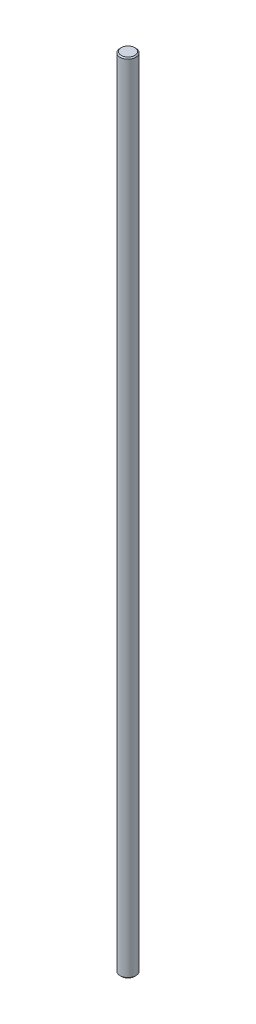
ISO-10303-21;
HEADER;
FILE_DESCRIPTION(('STEP AP214'),'2;1');
FILE_NAME('part.step','',(''),(''),'','','');
FILE_SCHEMA(('AUTOMOTIVE_DESIGN { 1 0 10303 214 1 1 1 1 }'));
ENDSEC;
DATA;
#1=APPLICATION_CONTEXT('core data for automotive mechanical design processes');
#2=APPLICATION_PROTOCOL_DEFINITION('international standard','automotive_design',2000,#1);
#3=PRODUCT_CONTEXT('',#1,'mechanical');
#4=PRODUCT('Part','Part','',(#3));
#5=PRODUCT_RELATED_PRODUCT_CATEGORY('part','',(#4));
#6=PRODUCT_DEFINITION_FORMATION('','',#4);
#7=PRODUCT_DEFINITION_CONTEXT('part definition',#1,'design');
#8=PRODUCT_DEFINITION('design','',#6,#7);
#9=PRODUCT_DEFINITION_SHAPE('','',#8);
#10=(LENGTH_UNIT() NAMED_UNIT(*) SI_UNIT(.MILLI.,.METRE.));
#11=(NAMED_UNIT(*) PLANE_ANGLE_UNIT() SI_UNIT($,.RADIAN.));
#12=(NAMED_UNIT(*) SI_UNIT($,.STERADIAN.) SOLID_ANGLE_UNIT());
#13=UNCERTAINTY_MEASURE_WITH_UNIT(LENGTH_MEASURE(1.E-05),#10,'distance_accuracy_value','');
#14=(GEOMETRIC_REPRESENTATION_CONTEXT(3) GLOBAL_UNCERTAINTY_ASSIGNED_CONTEXT((#13)) GLOBAL_UNIT_ASSIGNED_CONTEXT((#10,
#11,#12)) REPRESENTATION_CONTEXT('',''));
#15=CARTESIAN_POINT('',(0.,0.,0.));
#16=DIRECTION('',(0.,0.,1.));
#17=DIRECTION('',(1.,0.,0.));
#18=AXIS2_PLACEMENT_3D('',#15,#16,#17);
#19=CARTESIAN_POINT('',(0.,710.,0.));
#20=DIRECTION('',(0.,-1.,0.));
#21=DIRECTION('',(0.,0.,-1.));
#22=AXIS2_PLACEMENT_3D('',#19,#20,#21);
#23=CYLINDRICAL_SURFACE('',#22,7.);
#24=DIRECTION('',(0.,-1.,0.));
#25=VECTOR('',#24,1.);
#26=CARTESIAN_POINT('',(4.,710.,-5.74456264653803));
#27=LINE('',#26,#25);
#28=CARTESIAN_POINT('',(4.,236.,-5.74456264653803));
#29=VERTEX_POINT('',#28);
#30=CARTESIAN_POINT('',(4.,473.,-5.74456264653803));
#31=VERTEX_POINT('',#30);
#32=EDGE_CURVE('E47',#29,#31,#27,.F.);
#33=ORIENTED_EDGE('',*,*,#32,.T.);
#34=CARTESIAN_POINT('',(3.99999999999999,473.,-5.74456264653804));
#35=CARTESIAN_POINT('',(4.00002143590253,473.102267799723,-5.74452371324322));
#36=CARTESIAN_POINT('',(3.99607883430023,473.204513180416,-5.74729256524474));
#37=CARTESIAN_POINT('',(3.98043539907031,473.40803948732,-5.75815051881484));
#38=CARTESIAN_POINT('',(3.96874119071111,473.509321162285,-5.76623507702227));
#39=CARTESIAN_POINT('',(3.93787689539834,473.709444946865,-5.78735271082415));
#40=CARTESIAN_POINT('',(3.91876199023616,473.808299466083,-5.80034924155759));
#41=CARTESIAN_POINT('',(3.87334321428668,474.003632233979,-5.83077695110377));
#42=CARTESIAN_POINT('',(3.84703810912315,474.100110071539,-5.84820889132903));
#43=CARTESIAN_POINT('',(3.75799949911336,474.384464367199,-5.9061377584936));
#44=CARTESIAN_POINT('',(3.6850143581201,474.568071511496,-5.95236142454356));
#45=CARTESIAN_POINT('',(3.5142466837881,474.920573069424,-6.0547464828584));
#46=CARTESIAN_POINT('',(3.41641332319506,475.089436361353,-6.11092817230876));
#47=CARTESIAN_POINT('',(3.18634104077984,475.42765124983,-6.23426588641106));
#48=CARTESIAN_POINT('',(3.05151440124681,475.59505016869,-6.30195063162779));
#49=CARTESIAN_POINT('',(2.75652655885666,475.906464184931,-6.43644252342176));
#50=CARTESIAN_POINT('',(2.5963569398674,476.050471481894,-6.50324937044785));
#51=CARTESIAN_POINT('',(2.33095531633808,476.252786569404,-6.60126681147925));
#52=CARTESIAN_POINT('',(2.23359942046429,476.32041688373,-6.63492225042094));
#53=CARTESIAN_POINT('',(2.03256441910529,476.447141472492,-6.69923861969471));
#54=CARTESIAN_POINT('',(1.9288879219001,476.506239234539,-6.72990077183917));
#55=CARTESIAN_POINT('',(1.71584290166404,476.615273050641,-6.78734514736684));
#56=CARTESIAN_POINT('',(1.60647639402014,476.665212320631,-6.81412873198171));
#57=CARTESIAN_POINT('',(1.38278246406313,476.755322126529,-6.86301758887103));
#58=CARTESIAN_POINT('',(1.26845576883076,476.795494088499,-6.88512354403466));
#59=CARTESIAN_POINT('',(1.04606986327156,476.862383289302,-6.92223243110546));
#60=CARTESIAN_POINT('',(0.938349533807794,476.889975777829,-6.93769041049513));
#61=CARTESIAN_POINT('',(0.720419815770633,476.93616530485,-6.96369384599117));
#62=CARTESIAN_POINT('',(0.610210760979256,476.954763542218,-6.9742399568111));
#63=CARTESIAN_POINT('',(0.388320693428272,476.982675272936,-6.99010517480307));
#64=CARTESIAN_POINT('',(0.276640679659745,476.991994768595,-6.99542766104549));
#65=CARTESIAN_POINT('',(0.0527714685452697,477.001220331527,-7.00069636087085));
#66=CARTESIAN_POINT('',(-0.0594176830037816,477.001127229313,-7.0006430487838));
#67=CARTESIAN_POINT('',(-0.27058947464659,476.992073391034,-6.99547269262703));
#68=CARTESIAN_POINT('',(-0.369630447451218,476.984116953353,-6.99092914027604));
#69=CARTESIAN_POINT('',(-0.5665860128518,476.96091286091,-6.97773216829633));
#70=CARTESIAN_POINT('',(-0.664500250339889,476.945662968651,-6.96907748745437));
#71=CARTESIAN_POINT('',(-0.955449815000458,476.889221038937,-6.93722016463609));
#72=CARTESIAN_POINT('',(-1.1458912767167,476.8373277723,-6.90811880150434));
#73=CARTESIAN_POINT('',(-1.51638780414818,476.706694678576,-6.8364173834573));
#74=CARTESIAN_POINT('',(-1.69633548283321,476.627720284953,-6.79369962418915));
#75=CARTESIAN_POINT('',(-2.04074945418243,476.445765148982,-6.69830527485677));
#76=CARTESIAN_POINT('',(-2.20521128051851,476.342777510482,-6.64562582480528));
#77=CARTESIAN_POINT('',(-2.5338468958663,476.102515478004,-6.52789591066469));
#78=CARTESIAN_POINT('',(-2.695889970907,475.962682273257,-6.46212020897609));
#79=CARTESIAN_POINT('',(-2.9955501472632,475.659373372247,-6.32879490807702));
#80=CARTESIAN_POINT('',(-3.13313285033828,475.495864958726,-6.26124296172661));
#81=CARTESIAN_POINT('',(-3.39383812384774,475.130049666462,-6.12418573330373));
#82=CARTESIAN_POINT('',(-3.51412617382314,474.925496200348,-6.05516413093846));
#83=CARTESIAN_POINT('',(-3.66674662464544,474.60284894064,-5.96309578300388));
#84=CARTESIAN_POINT('',(-3.7129591822289,474.492757236216,-5.93433528645081));
#85=CARTESIAN_POINT('',(-3.79563645475018,474.267857117477,-5.88179739601786));
#86=CARTESIAN_POINT('',(-3.83210905533659,474.153052606158,-5.85801597437752));
#87=CARTESIAN_POINT('',(-3.88578713305528,473.95295360317,-5.82248889944103));
#88=CARTESIAN_POINT('',(-3.90552048657382,473.868591665945,-5.80924546050746));
#89=CARTESIAN_POINT('',(-3.93952792489833,473.698321038668,-5.78623708358002));
#90=CARTESIAN_POINT('',(-3.95380364114447,473.612412818897,-5.77647110613576));
#91=CARTESIAN_POINT('',(-3.97679410218095,473.439071634288,-5.76066976834655));
#92=CARTESIAN_POINT('',(-3.98548067104948,473.351633191778,-5.75465331474838));
#93=CARTESIAN_POINT('',(-3.99709173697599,473.176133603939,-5.74658739005435));
#94=CARTESIAN_POINT('',(-4.00001226335925,473.088072071382,-5.74454065264461));
#95=CARTESIAN_POINT('',(-3.99999999999999,473.,-5.74456264653804));
#96=B_SPLINE_CURVE_WITH_KNOTS('',3,(#34,#35,#36,#37,#38,#39,#40,#41,#42,#43,#44,#45,#46,#47,#48,
#49,#50,#51,#52,#53,#54,#55,#56,#57,#58,#59,#60,#61,#62,#63,#64,#65,#66,#67,#68,#69,#70,#71,#72,
#73,#74,#75,#76,#77,#78,#79,#80,#81,#82,#83,#84,#85,#86,#87,#88,#89,#90,#91,#92,#93,#94,#95),
.UNSPECIFIED.,.F.,.F.,(4,2,2,2,2,2,2,2,2,2,2,2,2,2,2,2,2,2,2,2,2,2,2,2,2,2,2,2,2,2,4),(0.,
0.306653533608742,0.613045308991185,0.917201037738456,1.22140901519327,1.82738029090111,
2.43460121179015,3.10800316325696,3.78162921548545,4.15089165316095,4.52000272792203,
4.88898394294326,5.25791125301271,5.59423825736663,5.93052041912938,6.26658490224294,
6.60261973295552,6.90064229248105,7.19875633856319,7.79439337568313,8.39532566849465,
8.99643075077225,9.66543105511249,10.335364847948,11.0724941913154,11.4404756771259,
11.8081583288605,12.0708683931414,12.3334998645283,12.597445145809,12.8615721246433),.UNSPECIFIED.);
#97=CARTESIAN_POINT('',(-3.99999999999998,473.,-5.74456264653805));
#98=VERTEX_POINT('',#97);
#99=EDGE_CURVE('E11',#31,#98,#96,.T.);
#100=ORIENTED_EDGE('',*,*,#99,.T.);
#101=DIRECTION('',(0.,-1.,0.));
#102=VECTOR('',#101,1.);
#103=CARTESIAN_POINT('',(-3.99999999999996,710.,-5.74456264653805));
#104=LINE('',#103,#102);
#105=CARTESIAN_POINT('',(-3.99999999999996,236.,-5.74456264653805));
#106=VERTEX_POINT('',#105);
#107=EDGE_CURVE('E81',#98,#106,#104,.T.);
#108=ORIENTED_EDGE('',*,*,#107,.T.);
#109=CARTESIAN_POINT('',(-4.,236.,-5.74456264653803));
#110=CARTESIAN_POINT('',(-4.00002143590254,235.897732200277,-5.74452371324321));
#111=CARTESIAN_POINT('',(-3.99607883430024,235.795486819584,-5.74729256524473));
#112=CARTESIAN_POINT('',(-3.98043539907032,235.59196051268,-5.75815051881483));
#113=CARTESIAN_POINT('',(-3.96874119071113,235.490678837715,-5.76623507702226));
#114=CARTESIAN_POINT('',(-3.93787689539835,235.290555053135,-5.78735271082414));
#115=CARTESIAN_POINT('',(-3.91876199023618,235.191700533917,-5.80034924155758));
#116=CARTESIAN_POINT('',(-3.87334321428669,234.99636776602,-5.83077695110376));
#117=CARTESIAN_POINT('',(-3.84703810912316,234.899889928461,-5.84820889132903));
#118=CARTESIAN_POINT('',(-3.75799949911335,234.615535632801,-5.9061377584936));
#119=CARTESIAN_POINT('',(-3.68501435812009,234.431928488504,-5.95236142454356));
#120=CARTESIAN_POINT('',(-3.51424668378809,234.079426930576,-6.0547464828584));
#121=CARTESIAN_POINT('',(-3.41641332319506,233.910563638647,-6.11092817230876));
#122=CARTESIAN_POINT('',(-3.18634104077984,233.57234875017,-6.23426588641106));
#123=CARTESIAN_POINT('',(-3.05151440124682,233.40494983131,-6.30195063162778));
#124=CARTESIAN_POINT('',(-2.75652655885666,233.093535815069,-6.43644252342176));
#125=CARTESIAN_POINT('',(-2.59635693986739,232.949528518106,-6.50324937044786));
#126=CARTESIAN_POINT('',(-2.33095531633807,232.747213430596,-6.60126681147926));
#127=CARTESIAN_POINT('',(-2.2335994204643,232.67958311627,-6.63492225042094));
#128=CARTESIAN_POINT('',(-2.03256441910531,232.552858527508,-6.6992386196947));
#129=CARTESIAN_POINT('',(-1.92888792190013,232.493760765461,-6.72990077183916));
#130=CARTESIAN_POINT('',(-1.71584290166406,232.384726949359,-6.78734514736683));
#131=CARTESIAN_POINT('',(-1.60647639402016,232.334787679369,-6.81412873198171));
#132=CARTESIAN_POINT('',(-1.38278246406314,232.244677873471,-6.86301758887103));
#133=CARTESIAN_POINT('',(-1.26845576883076,232.204505911501,-6.88512354403466));
#134=CARTESIAN_POINT('',(-1.04606986327154,232.137616710698,-6.92223243110546));
#135=CARTESIAN_POINT('',(-0.938349533807773,232.110024222171,-6.93769041049514));
#136=CARTESIAN_POINT('',(-0.720419815770606,232.06383469515,-6.96369384599118));
#137=CARTESIAN_POINT('',(-0.610210760979226,232.045236457781,-6.9742399568111));
#138=CARTESIAN_POINT('',(-0.388320693428239,232.017324727064,-6.99010517480307));
#139=CARTESIAN_POINT('',(-0.276640679659712,232.008005231405,-6.99542766104549));
#140=CARTESIAN_POINT('',(-0.052771468545235,231.998779668473,-7.00069636087085));
#141=CARTESIAN_POINT('',(0.0594176830038188,231.998872770687,-7.0006430487838));
#142=CARTESIAN_POINT('',(0.27058947464663,232.007926608966,-6.99547269262702));
#143=CARTESIAN_POINT('',(0.369630447451259,232.015883046647,-6.99092914027603));
#144=CARTESIAN_POINT('',(0.566586012851842,232.03908713909,-6.97773216829633));
#145=CARTESIAN_POINT('',(0.664500250339933,232.054337031349,-6.96907748745436));
#146=CARTESIAN_POINT('',(0.955449815000498,232.110778961063,-6.93722016463608));
#147=CARTESIAN_POINT('',(1.14589127671674,232.162672227699,-6.90811880150433));
#148=CARTESIAN_POINT('',(1.51638780414823,232.293305321424,-6.83641738345729));
#149=CARTESIAN_POINT('',(1.69633548283326,232.372279715047,-6.79369962418914));
#150=CARTESIAN_POINT('',(2.04074945418248,232.554234851018,-6.69830527485675));
#151=CARTESIAN_POINT('',(2.20521128051855,232.657222489518,-6.64562582480526));
#152=CARTESIAN_POINT('',(2.53384689586633,232.897484521996,-6.52789591066468));
#153=CARTESIAN_POINT('',(2.69588997090702,233.037317726742,-6.46212020897608));
#154=CARTESIAN_POINT('',(2.99555014726321,233.340626627752,-6.32879490807701));
#155=CARTESIAN_POINT('',(3.13313285033828,233.504135041274,-6.26124296172661));
#156=CARTESIAN_POINT('',(3.39383812384775,233.869950333538,-6.12418573330372));
#157=CARTESIAN_POINT('',(3.51412617382317,234.074503799652,-6.05516413093845));
#158=CARTESIAN_POINT('',(3.66674662464547,234.39715105936,-5.96309578300386));
#159=CARTESIAN_POINT('',(3.71295918222892,234.507242763784,-5.9343352864508));
#160=CARTESIAN_POINT('',(3.7956364547502,234.732142882523,-5.88179739601785));
#161=CARTESIAN_POINT('',(3.83210905533661,234.846947393842,-5.8580159743775));
#162=CARTESIAN_POINT('',(3.8857871330553,235.04704639683,-5.82248889944102));
#163=CARTESIAN_POINT('',(3.90552048657384,235.131408334055,-5.80924546050746));
#164=CARTESIAN_POINT('',(3.93952792489833,235.301678961332,-5.78623708358001));
#165=CARTESIAN_POINT('',(3.95380364114448,235.387587181103,-5.77647110613575));
#166=CARTESIAN_POINT('',(3.97679410218096,235.560928365712,-5.76066976834655));
#167=CARTESIAN_POINT('',(3.98548067104949,235.648366808222,-5.75465331474837));
#168=CARTESIAN_POINT('',(3.997091736976,235.823866396061,-5.74658739005435));
#169=CARTESIAN_POINT('',(4.00001226335925,235.911927928618,-5.7445406526446));
#170=CARTESIAN_POINT('',(4.,236.,-5.74456264653803));
#171=B_SPLINE_CURVE_WITH_KNOTS('',3,(#109,#110,#111,#112,#113,#114,#115,#116,#117,#118,#119,
#120,#121,#122,#123,#124,#125,#126,#127,#128,#129,#130,#131,#132,#133,#134,#135,#136,#137,#138,
#139,#140,#141,#142,#143,#144,#145,#146,#147,#148,#149,#150,#151,#152,#153,#154,#155,#156,#157,
#158,#159,#160,#161,#162,#163,#164,#165,#166,#167,#168,#169,#170),.UNSPECIFIED.,.F.,.F.,(4,2,2,
2,2,2,2,2,2,2,2,2,2,2,2,2,2,2,2,2,2,2,2,2,2,2,2,2,2,2,4),(0.,0.306653533608686,
0.613045308991157,0.917201037738454,1.2214090151933,1.82738029090112,2.43460121179018,
3.10800316325696,3.78162921548547,4.15089165316094,4.52000272792201,4.88898394294323,
5.25791125301274,5.59423825736666,5.93052041912942,6.26658490224298,6.60261973295556,
6.9006422924811,7.19875633856325,7.79439337568316,8.39532566849473,8.9964307507723,
9.6654310551125,10.335364847948,11.0724941913155,11.440475677126,11.8081583288605,
12.0708683931415,12.3334998645284,12.597445145809,12.8615721246433),.UNSPECIFIED.);
#172=EDGE_CURVE('E118',#106,#29,#171,.T.);
#173=ORIENTED_EDGE('',*,*,#172,.T.);
#174=EDGE_LOOP('',(#33,#100,#108,#173));
#175=FACE_BOUND('',#174,.T.);
#176=CARTESIAN_POINT('',(0.,1.,0.));
#177=DIRECTION('',(0.,1.,0.));
#178=DIRECTION('',(0.,0.,1.));
#179=AXIS2_PLACEMENT_3D('',#176,#177,#178);
#180=CIRCLE('',#179,7.);
#181=CARTESIAN_POINT('',(0.,1.,7.));
#182=VERTEX_POINT('',#181);
#183=EDGE_CURVE('E108',#182,#182,#180,.T.);
#184=ORIENTED_EDGE('',*,*,#183,.T.);
#185=EDGE_LOOP('',(#184));
#186=FACE_BOUND('',#185,.T.);
#187=CARTESIAN_POINT('',(0.,709.,0.));
#188=DIRECTION('',(0.,1.,0.));
#189=DIRECTION('',(0.,0.,1.));
#190=AXIS2_PLACEMENT_3D('',#187,#188,#189);
#191=CIRCLE('',#190,7.);
#192=CARTESIAN_POINT('',(0.,709.,7.));
#193=VERTEX_POINT('',#192);
#194=EDGE_CURVE('E102',#193,#193,#191,.F.);
#195=ORIENTED_EDGE('',*,*,#194,.T.);
#196=EDGE_LOOP('',(#195));
#197=FACE_BOUND('',#196,.T.);
#198=ADVANCED_FACE('F34',(#175,#186,#197),#23,.T.);
#199=CARTESIAN_POINT('',(0.,710.,0.));
#200=DIRECTION('',(0.,1.,0.));
#201=DIRECTION('',(0.,0.,1.));
#202=AXIS2_PLACEMENT_3D('',#199,#200,#201);
#203=PLANE('',#202);
#204=CARTESIAN_POINT('',(0.,710.,0.));
#205=DIRECTION('',(0.,1.,0.));
#206=DIRECTION('',(0.,0.,1.));
#207=AXIS2_PLACEMENT_3D('',#204,#205,#206);
#208=CIRCLE('',#207,6.00000000000001);
#209=CARTESIAN_POINT('',(0.,710.,6.00000000000001));
#210=VERTEX_POINT('',#209);
#211=EDGE_CURVE('E114',#210,#210,#208,.T.);
#212=ORIENTED_EDGE('',*,*,#211,.T.);
#213=EDGE_LOOP('',(#212));
#214=FACE_BOUND('',#213,.T.);
#215=ADVANCED_FACE('F138',(#214),#203,.T.);
#216=CARTESIAN_POINT('',(0.,0.,0.));
#217=DIRECTION('',(0.,1.,0.));
#218=DIRECTION('',(0.,0.,1.));
#219=AXIS2_PLACEMENT_3D('',#216,#217,#218);
#220=PLANE('',#219);
#221=CARTESIAN_POINT('',(0.,0.,0.));
#222=DIRECTION('',(0.,1.,0.));
#223=DIRECTION('',(0.,0.,1.));
#224=AXIS2_PLACEMENT_3D('',#221,#222,#223);
#225=CIRCLE('',#224,6.00000000000001);
#226=CARTESIAN_POINT('',(0.,0.,6.00000000000001));
#227=VERTEX_POINT('',#226);
#228=EDGE_CURVE('E111',#227,#227,#225,.F.);
#229=ORIENTED_EDGE('',*,*,#228,.T.);
#230=EDGE_LOOP('',(#229));
#231=FACE_BOUND('',#230,.T.);
#232=ADVANCED_FACE('F140',(#231),#220,.F.);
#233=CARTESIAN_POINT('',(0.,1.,0.));
#234=DIRECTION('',(0.,1.,0.));
#235=DIRECTION('',(0.,0.,1.));
#236=AXIS2_PLACEMENT_3D('',#233,#234,#235);
#237=CONICAL_SURFACE('',#236,7.,0.785398163397445);
#238=ORIENTED_EDGE('',*,*,#228,.F.);
#239=EDGE_LOOP('',(#238));
#240=FACE_BOUND('',#239,.T.);
#241=ORIENTED_EDGE('',*,*,#183,.F.);
#242=EDGE_LOOP('',(#241));
#243=FACE_BOUND('',#242,.T.);
#244=ADVANCED_FACE('F143',(#240,#243),#237,.T.);
#245=CARTESIAN_POINT('',(0.,710.,0.));
#246=DIRECTION('',(0.,-1.,0.));
#247=DIRECTION('',(0.,0.,-1.));
#248=AXIS2_PLACEMENT_3D('',#245,#246,#247);
#249=CONICAL_SURFACE('',#248,6.00000000000001,0.785398163397445);
#250=ORIENTED_EDGE('',*,*,#194,.F.);
#251=EDGE_LOOP('',(#250));
#252=FACE_BOUND('',#251,.T.);
#253=ORIENTED_EDGE('',*,*,#211,.F.);
#254=EDGE_LOOP('',(#253));
#255=FACE_BOUND('',#254,.T.);
#256=ADVANCED_FACE('F36',(#252,#255),#249,.T.);
#257=CARTESIAN_POINT('',(0.,473.,-9.));
#258=DIRECTION('',(0.,0.,1.));
#259=DIRECTION('',(1.,0.,0.));
#260=AXIS2_PLACEMENT_3D('',#257,#258,#259);
#261=CYLINDRICAL_SURFACE('',#260,3.99999999999999);
#262=DIRECTION('',(0.,0.,1.));
#263=VECTOR('',#262,1.);
#264=CARTESIAN_POINT('',(4.,473.,-9.));
#265=LINE('',#264,#263);
#266=CARTESIAN_POINT('',(4.,473.,1.));
#267=VERTEX_POINT('',#266);
#268=EDGE_CURVE('E96',#31,#267,#265,.T.);
#269=ORIENTED_EDGE('',*,*,#268,.T.);
#270=CARTESIAN_POINT('',(0.,473.,1.));
#271=DIRECTION('',(0.,0.,1.));
#272=DIRECTION('',(1.,0.,0.));
#273=AXIS2_PLACEMENT_3D('',#270,#271,#272);
#274=CIRCLE('',#273,3.99999999999999);
#275=CARTESIAN_POINT('',(-3.99999999999998,473.,1.));
#276=VERTEX_POINT('',#275);
#277=EDGE_CURVE('E90',#267,#276,#274,.T.);
#278=ORIENTED_EDGE('',*,*,#277,.T.);
#279=DIRECTION('',(0.,0.,1.));
#280=VECTOR('',#279,1.);
#281=CARTESIAN_POINT('',(-3.99999999999998,473.,-9.));
#282=LINE('',#281,#280);
#283=EDGE_CURVE('E76',#98,#276,#282,.T.);
#284=ORIENTED_EDGE('',*,*,#283,.F.);
#285=ORIENTED_EDGE('',*,*,#99,.F.);
#286=EDGE_LOOP('',(#269,#278,#284,#285));
#287=FACE_BOUND('',#286,.T.);
#288=ADVANCED_FACE('F95',(#287),#261,.F.);
#289=CARTESIAN_POINT('',(4.,236.,-9.));
#290=DIRECTION('',(1.,0.,0.));
#291=DIRECTION('',(0.,1.,0.));
#292=AXIS2_PLACEMENT_3D('',#289,#290,#291);
#293=PLANE('',#292);
#294=DIRECTION('',(0.,0.,1.));
#295=VECTOR('',#294,1.);
#296=CARTESIAN_POINT('',(4.,236.,-9.));
#297=LINE('',#296,#295);
#298=CARTESIAN_POINT('',(4.,236.,1.));
#299=VERTEX_POINT('',#298);
#300=EDGE_CURVE('E103',#29,#299,#297,.T.);
#301=ORIENTED_EDGE('',*,*,#300,.T.);
#302=DIRECTION('',(0.,1.,0.));
#303=VECTOR('',#302,1.);
#304=CARTESIAN_POINT('',(4.,236.,1.));
#305=LINE('',#304,#303);
#306=EDGE_CURVE('E83',#299,#267,#305,.T.);
#307=ORIENTED_EDGE('',*,*,#306,.T.);
#308=ORIENTED_EDGE('',*,*,#268,.F.);
#309=ORIENTED_EDGE('',*,*,#32,.F.);
#310=EDGE_LOOP('',(#301,#307,#308,#309));
#311=FACE_BOUND('',#310,.T.);
#312=ADVANCED_FACE('F131',(#311),#293,.F.);
#313=CARTESIAN_POINT('',(0.,236.,-9.));
#314=DIRECTION('',(0.,0.,1.));
#315=DIRECTION('',(1.,0.,0.));
#316=AXIS2_PLACEMENT_3D('',#313,#314,#315);
#317=CYLINDRICAL_SURFACE('',#316,4.);
#318=DIRECTION('',(0.,0.,1.));
#319=VECTOR('',#318,1.);
#320=CARTESIAN_POINT('',(-4.,236.,-9.));
#321=LINE('',#320,#319);
#322=CARTESIAN_POINT('',(-4.,236.,1.));
#323=VERTEX_POINT('',#322);
#324=EDGE_CURVE('E54',#106,#323,#321,.T.);
#325=ORIENTED_EDGE('',*,*,#324,.T.);
#326=CARTESIAN_POINT('',(0.,236.,1.));
#327=DIRECTION('',(0.,0.,1.));
#328=DIRECTION('',(1.,0.,0.));
#329=AXIS2_PLACEMENT_3D('',#326,#327,#328);
#330=CIRCLE('',#329,4.);
#331=EDGE_CURVE('E93',#323,#299,#330,.T.);
#332=ORIENTED_EDGE('',*,*,#331,.T.);
#333=ORIENTED_EDGE('',*,*,#300,.F.);
#334=ORIENTED_EDGE('',*,*,#172,.F.);
#335=EDGE_LOOP('',(#325,#332,#333,#334));
#336=FACE_BOUND('',#335,.T.);
#337=ADVANCED_FACE('F126',(#336),#317,.F.);
#338=CARTESIAN_POINT('',(-3.99999999999998,473.,-9.));
#339=DIRECTION('',(-1.,0.,0.));
#340=DIRECTION('',(0.,-1.,0.));
#341=AXIS2_PLACEMENT_3D('',#338,#339,#340);
#342=PLANE('',#341);
#343=ORIENTED_EDGE('',*,*,#283,.T.);
#344=DIRECTION('',(0.,-1.,0.));
#345=VECTOR('',#344,1.);
#346=CARTESIAN_POINT('',(-3.99999999999998,473.,1.));
#347=LINE('',#346,#345);
#348=EDGE_CURVE('E79',#276,#323,#347,.T.);
#349=ORIENTED_EDGE('',*,*,#348,.T.);
#350=ORIENTED_EDGE('',*,*,#324,.F.);
#351=ORIENTED_EDGE('',*,*,#107,.F.);
#352=EDGE_LOOP('',(#343,#349,#350,#351));
#353=FACE_BOUND('',#352,.T.);
#354=ADVANCED_FACE('F78',(#353),#342,.F.);
#355=CARTESIAN_POINT('',(0.,473.,1.));
#356=DIRECTION('',(0.,0.,1.));
#357=DIRECTION('',(1.,0.,0.));
#358=AXIS2_PLACEMENT_3D('',#355,#356,#357);
#359=PLANE('',#358);
#360=ORIENTED_EDGE('',*,*,#277,.F.);
#361=ORIENTED_EDGE('',*,*,#306,.F.);
#362=ORIENTED_EDGE('',*,*,#331,.F.);
#363=ORIENTED_EDGE('',*,*,#348,.F.);
#364=EDGE_LOOP('',(#360,#361,#362,#363));
#365=FACE_BOUND('',#364,.T.);
#366=ADVANCED_FACE('F88',(#365),#359,.F.);
#367=CLOSED_SHELL('',(#198,#215,#232,#244,#256,#288,#312,#337,#354,#366));
#368=MANIFOLD_SOLID_BREP('B2',#367);
#369=ADVANCED_BREP_SHAPE_REPRESENTATION('',(#18,#368),#14);
#370=SHAPE_DEFINITION_REPRESENTATION(#9,#369);
ENDSEC;
END-ISO-10303-21;
